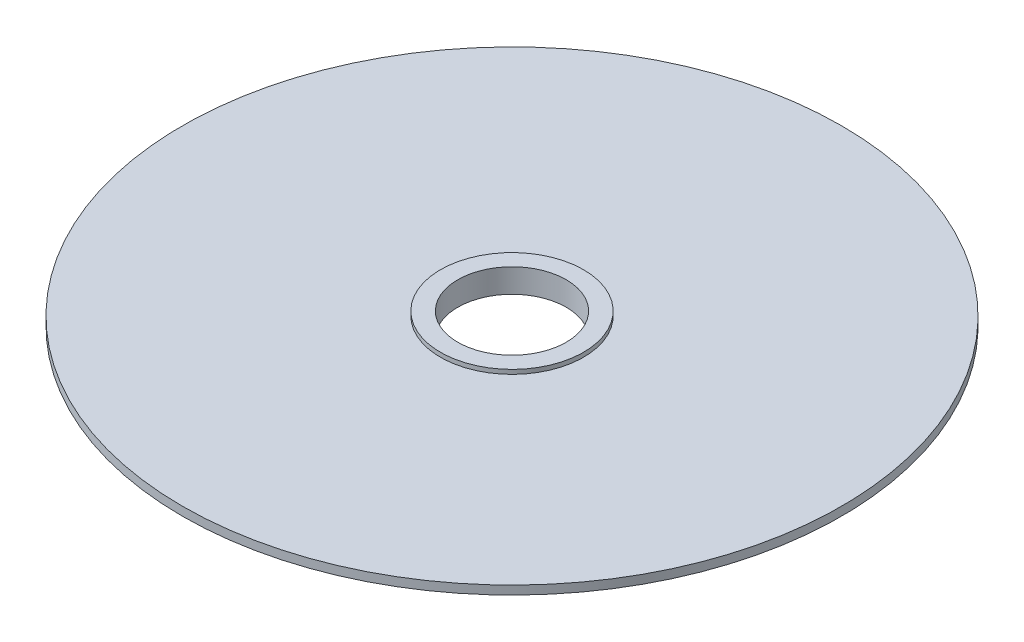
ISO-10303-21;
HEADER;
FILE_DESCRIPTION(('STEP AP214'),'2;1');
FILE_NAME('part.step','',(''),(''),'','','');
FILE_SCHEMA(('AUTOMOTIVE_DESIGN { 1 0 10303 214 1 1 1 1 }'));
ENDSEC;
DATA;
#1=APPLICATION_CONTEXT('core data for automotive mechanical design processes');
#2=APPLICATION_PROTOCOL_DEFINITION('international standard','automotive_design',2000,#1);
#3=PRODUCT_CONTEXT('',#1,'mechanical');
#4=PRODUCT('Part','Part','',(#3));
#5=PRODUCT_RELATED_PRODUCT_CATEGORY('part','',(#4));
#6=PRODUCT_DEFINITION_FORMATION('','',#4);
#7=PRODUCT_DEFINITION_CONTEXT('part definition',#1,'design');
#8=PRODUCT_DEFINITION('design','',#6,#7);
#9=PRODUCT_DEFINITION_SHAPE('','',#8);
#10=(LENGTH_UNIT() NAMED_UNIT(*) SI_UNIT(.MILLI.,.METRE.));
#11=(NAMED_UNIT(*) PLANE_ANGLE_UNIT() SI_UNIT($,.RADIAN.));
#12=(NAMED_UNIT(*) SI_UNIT($,.STERADIAN.) SOLID_ANGLE_UNIT());
#13=UNCERTAINTY_MEASURE_WITH_UNIT(LENGTH_MEASURE(1.E-05),#10,'distance_accuracy_value','');
#14=(GEOMETRIC_REPRESENTATION_CONTEXT(3) GLOBAL_UNCERTAINTY_ASSIGNED_CONTEXT((#13)) GLOBAL_UNIT_ASSIGNED_CONTEXT((#10,
#11,#12)) REPRESENTATION_CONTEXT('',''));
#15=CARTESIAN_POINT('',(0.,0.,0.));
#16=DIRECTION('',(0.,0.,1.));
#17=DIRECTION('',(1.,0.,0.));
#18=AXIS2_PLACEMENT_3D('',#15,#16,#17);
#19=CARTESIAN_POINT('',(0.,-1.85,0.));
#20=DIRECTION('',(0.,1.,0.));
#21=DIRECTION('',(0.,0.,1.));
#22=AXIS2_PLACEMENT_3D('',#19,#20,#21);
#23=CONICAL_SURFACE('',#22,3.75,0.785398163397452);
#24=CARTESIAN_POINT('',(0.,-1.6,0.));
#25=DIRECTION('',(0.,-1.,0.));
#26=DIRECTION('',(0.,0.,-1.));
#27=AXIS2_PLACEMENT_3D('',#24,#25,#26);
#28=CIRCLE('',#27,4.);
#29=CARTESIAN_POINT('',(0.,-1.6,-4.));
#30=VERTEX_POINT('',#29);
#31=EDGE_CURVE('E58',#30,#30,#28,.T.);
#32=ORIENTED_EDGE('',*,*,#31,.T.);
#33=EDGE_LOOP('',(#32));
#34=FACE_BOUND('',#33,.T.);
#35=CARTESIAN_POINT('',(0.,-1.85,0.));
#36=DIRECTION('',(0.,-1.,0.));
#37=DIRECTION('',(0.,0.,-1.));
#38=AXIS2_PLACEMENT_3D('',#35,#36,#37);
#39=CIRCLE('',#38,3.75);
#40=CARTESIAN_POINT('',(0.,-1.85,-3.75));
#41=VERTEX_POINT('',#40);
#42=EDGE_CURVE('E10',#41,#41,#39,.T.);
#43=ORIENTED_EDGE('',*,*,#42,.F.);
#44=EDGE_LOOP('',(#43));
#45=FACE_BOUND('',#44,.T.);
#46=ADVANCED_FACE('F30',(#34,#45),#23,.T.);
#47=CARTESIAN_POINT('',(1.25,-1.85,0.));
#48=DIRECTION('',(0.,-1.,0.));
#49=DIRECTION('',(0.,0.,-1.));
#50=AXIS2_PLACEMENT_3D('',#47,#48,#49);
#51=PLANE('',#50);
#52=ORIENTED_EDGE('',*,*,#42,.T.);
#53=EDGE_LOOP('',(#52));
#54=FACE_BOUND('',#53,.T.);
#55=CARTESIAN_POINT('',(0.,-1.85,0.));
#56=DIRECTION('',(0.,-1.,0.));
#57=DIRECTION('',(0.,0.,-1.));
#58=AXIS2_PLACEMENT_3D('',#55,#56,#57);
#59=CIRCLE('',#58,1.25);
#60=CARTESIAN_POINT('',(0.,-1.85,-1.25));
#61=VERTEX_POINT('',#60);
#62=EDGE_CURVE('E36',#61,#61,#59,.T.);
#63=ORIENTED_EDGE('',*,*,#62,.F.);
#64=EDGE_LOOP('',(#63));
#65=FACE_BOUND('',#64,.T.);
#66=ADVANCED_FACE('F76',(#54,#65),#51,.T.);
#67=CARTESIAN_POINT('',(0.,-1.3,0.));
#68=DIRECTION('',(0.,-1.,0.));
#69=DIRECTION('',(0.,0.,-1.));
#70=AXIS2_PLACEMENT_3D('',#67,#68,#69);
#71=CYLINDRICAL_SURFACE('',#70,1.25);
#72=ORIENTED_EDGE('',*,*,#62,.T.);
#73=EDGE_LOOP('',(#72));
#74=FACE_BOUND('',#73,.T.);
#75=CARTESIAN_POINT('',(0.,-1.3,0.));
#76=DIRECTION('',(0.,-1.,0.));
#77=DIRECTION('',(0.,0.,-1.));
#78=AXIS2_PLACEMENT_3D('',#75,#76,#77);
#79=CIRCLE('',#78,1.25);
#80=CARTESIAN_POINT('',(0.,-1.3,-1.25));
#81=VERTEX_POINT('',#80);
#82=EDGE_CURVE('E40',#81,#81,#79,.T.);
#83=ORIENTED_EDGE('',*,*,#82,.F.);
#84=EDGE_LOOP('',(#83));
#85=FACE_BOUND('',#84,.T.);
#86=ADVANCED_FACE('F80',(#74,#85),#71,.F.);
#87=CARTESIAN_POINT('',(1.65,-1.3,0.));
#88=DIRECTION('',(0.,1.,0.));
#89=DIRECTION('',(0.,0.,1.));
#90=AXIS2_PLACEMENT_3D('',#87,#88,#89);
#91=PLANE('',#90);
#92=ORIENTED_EDGE('',*,*,#82,.T.);
#93=EDGE_LOOP('',(#92));
#94=FACE_BOUND('',#93,.T.);
#95=CARTESIAN_POINT('',(0.,-1.3,0.));
#96=DIRECTION('',(0.,-1.,0.));
#97=DIRECTION('',(0.,0.,-1.));
#98=AXIS2_PLACEMENT_3D('',#95,#96,#97);
#99=CIRCLE('',#98,1.65);
#100=CARTESIAN_POINT('',(0.,-1.3,-1.65));
#101=VERTEX_POINT('',#100);
#102=EDGE_CURVE('E44',#101,#101,#99,.T.);
#103=ORIENTED_EDGE('',*,*,#102,.F.);
#104=EDGE_LOOP('',(#103));
#105=FACE_BOUND('',#104,.T.);
#106=ADVANCED_FACE('F84',(#94,#105),#91,.T.);
#107=CARTESIAN_POINT('',(0.,-1.3,0.));
#108=DIRECTION('',(0.,-1.,0.));
#109=DIRECTION('',(0.,0.,-1.));
#110=AXIS2_PLACEMENT_3D('',#107,#108,#109);
#111=CYLINDRICAL_SURFACE('',#110,1.65);
#112=ORIENTED_EDGE('',*,*,#102,.T.);
#113=EDGE_LOOP('',(#112));
#114=FACE_BOUND('',#113,.T.);
#115=CARTESIAN_POINT('',(0.,-1.4,0.));
#116=DIRECTION('',(0.,-1.,0.));
#117=DIRECTION('',(0.,0.,-1.));
#118=AXIS2_PLACEMENT_3D('',#115,#116,#117);
#119=CIRCLE('',#118,1.65);
#120=CARTESIAN_POINT('',(0.,-1.4,-1.65));
#121=VERTEX_POINT('',#120);
#122=EDGE_CURVE('E49',#121,#121,#119,.T.);
#123=ORIENTED_EDGE('',*,*,#122,.F.);
#124=EDGE_LOOP('',(#123));
#125=FACE_BOUND('',#124,.T.);
#126=ADVANCED_FACE('F90',(#114,#125),#111,.T.);
#127=CARTESIAN_POINT('',(7.6,-1.4,0.));
#128=DIRECTION('',(0.,1.,0.));
#129=DIRECTION('',(0.,0.,1.));
#130=AXIS2_PLACEMENT_3D('',#127,#128,#129);
#131=PLANE('',#130);
#132=ORIENTED_EDGE('',*,*,#122,.T.);
#133=EDGE_LOOP('',(#132));
#134=FACE_BOUND('',#133,.T.);
#135=CARTESIAN_POINT('',(0.,-1.4,0.));
#136=DIRECTION('',(0.,-1.,0.));
#137=DIRECTION('',(0.,0.,-1.));
#138=AXIS2_PLACEMENT_3D('',#135,#136,#137);
#139=CIRCLE('',#138,7.6);
#140=CARTESIAN_POINT('',(0.,-1.4,-7.6));
#141=VERTEX_POINT('',#140);
#142=EDGE_CURVE('E52',#141,#141,#139,.T.);
#143=ORIENTED_EDGE('',*,*,#142,.F.);
#144=EDGE_LOOP('',(#143));
#145=FACE_BOUND('',#144,.T.);
#146=ADVANCED_FACE('F72',(#134,#145),#131,.T.);
#147=CARTESIAN_POINT('',(0.,-1.3,0.));
#148=DIRECTION('',(0.,-1.,0.));
#149=DIRECTION('',(0.,0.,-1.));
#150=AXIS2_PLACEMENT_3D('',#147,#148,#149);
#151=CYLINDRICAL_SURFACE('',#150,7.6);
#152=ORIENTED_EDGE('',*,*,#142,.T.);
#153=EDGE_LOOP('',(#152));
#154=FACE_BOUND('',#153,.T.);
#155=CARTESIAN_POINT('',(0.,-1.6,0.));
#156=DIRECTION('',(0.,-1.,0.));
#157=DIRECTION('',(0.,0.,-1.));
#158=AXIS2_PLACEMENT_3D('',#155,#156,#157);
#159=CIRCLE('',#158,7.6);
#160=CARTESIAN_POINT('',(0.,-1.6,-7.6));
#161=VERTEX_POINT('',#160);
#162=EDGE_CURVE('E55',#161,#161,#159,.T.);
#163=ORIENTED_EDGE('',*,*,#162,.F.);
#164=EDGE_LOOP('',(#163));
#165=FACE_BOUND('',#164,.T.);
#166=ADVANCED_FACE('F66',(#154,#165),#151,.T.);
#167=CARTESIAN_POINT('',(4.,-1.6,0.));
#168=DIRECTION('',(0.,-1.,0.));
#169=DIRECTION('',(0.,0.,-1.));
#170=AXIS2_PLACEMENT_3D('',#167,#168,#169);
#171=PLANE('',#170);
#172=ORIENTED_EDGE('',*,*,#162,.T.);
#173=EDGE_LOOP('',(#172));
#174=FACE_BOUND('',#173,.T.);
#175=ORIENTED_EDGE('',*,*,#31,.F.);
#176=EDGE_LOOP('',(#175));
#177=FACE_BOUND('',#176,.T.);
#178=ADVANCED_FACE('F64',(#174,#177),#171,.T.);
#179=CLOSED_SHELL('',(#46,#66,#86,#106,#126,#146,#166,#178));
#180=MANIFOLD_SOLID_BREP('B2',#179);
#181=ADVANCED_BREP_SHAPE_REPRESENTATION('',(#18,#180),#14);
#182=SHAPE_DEFINITION_REPRESENTATION(#9,#181);
ENDSEC;
END-ISO-10303-21;
